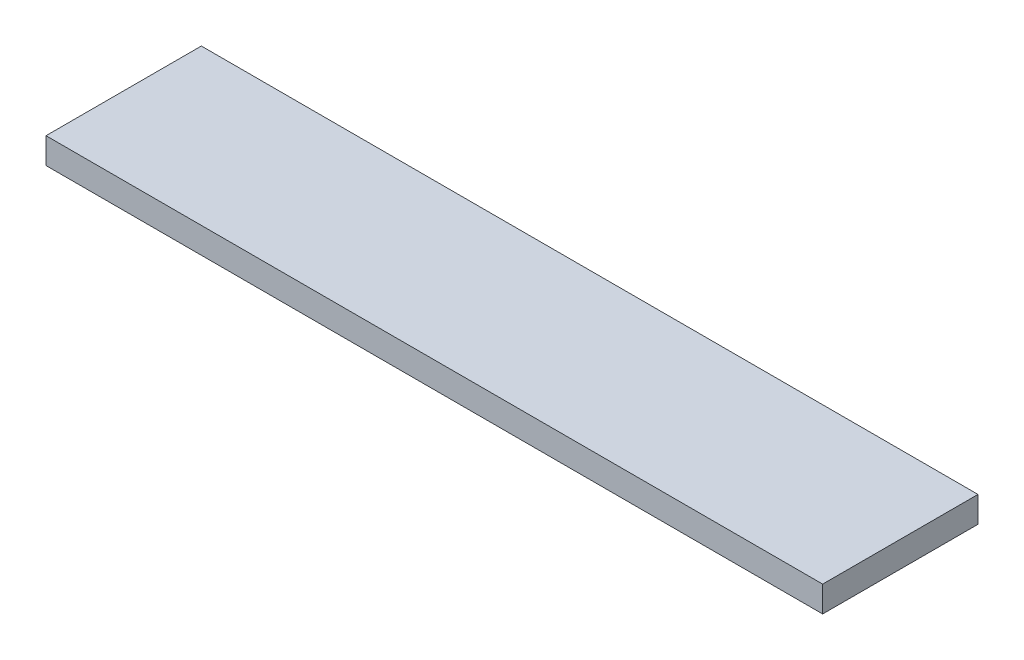
ISO-10303-21;
HEADER;
FILE_DESCRIPTION(('STEP AP214'),'2;1');
FILE_NAME('part.step','',(''),(''),'','','');
FILE_SCHEMA(('AUTOMOTIVE_DESIGN { 1 0 10303 214 1 1 1 1 }'));
ENDSEC;
DATA;
#1=APPLICATION_CONTEXT('core data for automotive mechanical design processes');
#2=APPLICATION_PROTOCOL_DEFINITION('international standard','automotive_design',2000,#1);
#3=PRODUCT_CONTEXT('',#1,'mechanical');
#4=PRODUCT('Part','Part','',(#3));
#5=PRODUCT_RELATED_PRODUCT_CATEGORY('part','',(#4));
#6=PRODUCT_DEFINITION_FORMATION('','',#4);
#7=PRODUCT_DEFINITION_CONTEXT('part definition',#1,'design');
#8=PRODUCT_DEFINITION('design','',#6,#7);
#9=PRODUCT_DEFINITION_SHAPE('','',#8);
#10=(LENGTH_UNIT() NAMED_UNIT(*) SI_UNIT(.MILLI.,.METRE.));
#11=(NAMED_UNIT(*) PLANE_ANGLE_UNIT() SI_UNIT($,.RADIAN.));
#12=(NAMED_UNIT(*) SI_UNIT($,.STERADIAN.) SOLID_ANGLE_UNIT());
#13=UNCERTAINTY_MEASURE_WITH_UNIT(LENGTH_MEASURE(1.E-05),#10,'distance_accuracy_value','');
#14=(GEOMETRIC_REPRESENTATION_CONTEXT(3) GLOBAL_UNCERTAINTY_ASSIGNED_CONTEXT((#13)) GLOBAL_UNIT_ASSIGNED_CONTEXT((#10,
#11,#12)) REPRESENTATION_CONTEXT('',''));
#15=CARTESIAN_POINT('',(0.,0.,0.));
#16=DIRECTION('',(0.,0.,1.));
#17=DIRECTION('',(1.,0.,0.));
#18=AXIS2_PLACEMENT_3D('',#15,#16,#17);
#19=CARTESIAN_POINT('',(95.25,6.35,-19.05));
#20=DIRECTION('',(-1.,0.,0.));
#21=DIRECTION('',(0.,0.,1.));
#22=AXIS2_PLACEMENT_3D('',#19,#20,#21);
#23=PLANE('',#22);
#24=DIRECTION('',(0.,0.,-1.));
#25=VECTOR('',#24,1.);
#26=CARTESIAN_POINT('',(95.25,0.,-19.05));
#27=LINE('',#26,#25);
#28=CARTESIAN_POINT('',(95.25,0.,19.05));
#29=VERTEX_POINT('',#28);
#30=CARTESIAN_POINT('',(95.25,0.,-19.05));
#31=VERTEX_POINT('',#30);
#32=EDGE_CURVE('E107',#29,#31,#27,.T.);
#33=ORIENTED_EDGE('',*,*,#32,.T.);
#34=DIRECTION('',(0.,-1.,0.));
#35=VECTOR('',#34,1.);
#36=CARTESIAN_POINT('',(95.25,6.35,-19.05));
#37=LINE('',#36,#35);
#38=CARTESIAN_POINT('',(95.25,6.35,-19.05));
#39=VERTEX_POINT('',#38);
#40=EDGE_CURVE('E11',#39,#31,#37,.T.);
#41=ORIENTED_EDGE('',*,*,#40,.F.);
#42=DIRECTION('',(0.,0.,-1.));
#43=VECTOR('',#42,1.);
#44=CARTESIAN_POINT('',(95.25,6.35,-19.05));
#45=LINE('',#44,#43);
#46=CARTESIAN_POINT('',(95.25,6.35,19.05));
#47=VERTEX_POINT('',#46);
#48=EDGE_CURVE('E91',#47,#39,#45,.T.);
#49=ORIENTED_EDGE('',*,*,#48,.F.);
#50=DIRECTION('',(0.,-1.,0.));
#51=VECTOR('',#50,1.);
#52=CARTESIAN_POINT('',(95.25,6.35,19.05));
#53=LINE('',#52,#51);
#54=EDGE_CURVE('E103',#47,#29,#53,.T.);
#55=ORIENTED_EDGE('',*,*,#54,.T.);
#56=EDGE_LOOP('',(#33,#41,#49,#55));
#57=FACE_BOUND('',#56,.T.);
#58=ADVANCED_FACE('F39',(#57),#23,.F.);
#59=CARTESIAN_POINT('',(-95.25,6.35,-19.05));
#60=DIRECTION('',(0.,0.,1.));
#61=DIRECTION('',(1.,0.,0.));
#62=AXIS2_PLACEMENT_3D('',#59,#60,#61);
#63=PLANE('',#62);
#64=DIRECTION('',(-1.,0.,0.));
#65=VECTOR('',#64,1.);
#66=CARTESIAN_POINT('',(-95.25,0.,-19.05));
#67=LINE('',#66,#65);
#68=CARTESIAN_POINT('',(-95.25,0.,-19.05));
#69=VERTEX_POINT('',#68);
#70=EDGE_CURVE('E96',#31,#69,#67,.T.);
#71=ORIENTED_EDGE('',*,*,#70,.T.);
#72=DIRECTION('',(0.,-1.,0.));
#73=VECTOR('',#72,1.);
#74=CARTESIAN_POINT('',(-95.25,6.35,-19.05));
#75=LINE('',#74,#73);
#76=CARTESIAN_POINT('',(-95.25,6.35,-19.05));
#77=VERTEX_POINT('',#76);
#78=EDGE_CURVE('E48',#77,#69,#75,.T.);
#79=ORIENTED_EDGE('',*,*,#78,.F.);
#80=DIRECTION('',(-1.,0.,0.));
#81=VECTOR('',#80,1.);
#82=CARTESIAN_POINT('',(-95.25,6.35,-19.05));
#83=LINE('',#82,#81);
#84=EDGE_CURVE('E86',#39,#77,#83,.T.);
#85=ORIENTED_EDGE('',*,*,#84,.F.);
#86=ORIENTED_EDGE('',*,*,#40,.T.);
#87=EDGE_LOOP('',(#71,#79,#85,#86));
#88=FACE_BOUND('',#87,.T.);
#89=ADVANCED_FACE('F95',(#88),#63,.F.);
#90=CARTESIAN_POINT('',(-95.25,6.35,-19.05));
#91=DIRECTION('',(1.,0.,0.));
#92=DIRECTION('',(0.,0.,-1.));
#93=AXIS2_PLACEMENT_3D('',#90,#91,#92);
#94=PLANE('',#93);
#95=DIRECTION('',(0.,0.,1.));
#96=VECTOR('',#95,1.);
#97=CARTESIAN_POINT('',(-95.25,0.,-19.05));
#98=LINE('',#97,#96);
#99=CARTESIAN_POINT('',(-95.25,0.,19.05));
#100=VERTEX_POINT('',#99);
#101=EDGE_CURVE('E73',#69,#100,#98,.T.);
#102=ORIENTED_EDGE('',*,*,#101,.T.);
#103=DIRECTION('',(0.,-1.,0.));
#104=VECTOR('',#103,1.);
#105=CARTESIAN_POINT('',(-95.25,6.35,19.05));
#106=LINE('',#105,#104);
#107=CARTESIAN_POINT('',(-95.25,6.35,19.05));
#108=VERTEX_POINT('',#107);
#109=EDGE_CURVE('E98',#108,#100,#106,.T.);
#110=ORIENTED_EDGE('',*,*,#109,.F.);
#111=DIRECTION('',(0.,0.,1.));
#112=VECTOR('',#111,1.);
#113=CARTESIAN_POINT('',(-95.25,6.35,-19.05));
#114=LINE('',#113,#112);
#115=EDGE_CURVE('E89',#77,#108,#114,.T.);
#116=ORIENTED_EDGE('',*,*,#115,.F.);
#117=ORIENTED_EDGE('',*,*,#78,.T.);
#118=EDGE_LOOP('',(#102,#110,#116,#117));
#119=FACE_BOUND('',#118,.T.);
#120=ADVANCED_FACE('F99',(#119),#94,.F.);
#121=CARTESIAN_POINT('',(-95.25,6.35,19.05));
#122=DIRECTION('',(0.,0.,-1.));
#123=DIRECTION('',(-1.,0.,0.));
#124=AXIS2_PLACEMENT_3D('',#121,#122,#123);
#125=PLANE('',#124);
#126=DIRECTION('',(1.,0.,0.));
#127=VECTOR('',#126,1.);
#128=CARTESIAN_POINT('',(-95.25,0.,19.05));
#129=LINE('',#128,#127);
#130=EDGE_CURVE('E79',#100,#29,#129,.T.);
#131=ORIENTED_EDGE('',*,*,#130,.T.);
#132=ORIENTED_EDGE('',*,*,#54,.F.);
#133=DIRECTION('',(1.,0.,0.));
#134=VECTOR('',#133,1.);
#135=CARTESIAN_POINT('',(-95.25,6.35,19.05));
#136=LINE('',#135,#134);
#137=EDGE_CURVE('E56',#108,#47,#136,.T.);
#138=ORIENTED_EDGE('',*,*,#137,.F.);
#139=ORIENTED_EDGE('',*,*,#109,.T.);
#140=EDGE_LOOP('',(#131,#132,#138,#139));
#141=FACE_BOUND('',#140,.T.);
#142=ADVANCED_FACE('F120',(#141),#125,.F.);
#143=CARTESIAN_POINT('',(0.,6.35,0.));
#144=DIRECTION('',(0.,1.,0.));
#145=DIRECTION('',(0.,0.,1.));
#146=AXIS2_PLACEMENT_3D('',#143,#144,#145);
#147=PLANE('',#146);
#148=ORIENTED_EDGE('',*,*,#48,.T.);
#149=ORIENTED_EDGE('',*,*,#84,.T.);
#150=ORIENTED_EDGE('',*,*,#115,.T.);
#151=ORIENTED_EDGE('',*,*,#137,.T.);
#152=EDGE_LOOP('',(#148,#149,#150,#151));
#153=FACE_BOUND('',#152,.T.);
#154=ADVANCED_FACE('F87',(#153),#147,.T.);
#155=CARTESIAN_POINT('',(0.,0.,0.));
#156=DIRECTION('',(0.,1.,0.));
#157=DIRECTION('',(0.,0.,1.));
#158=AXIS2_PLACEMENT_3D('',#155,#156,#157);
#159=PLANE('',#158);
#160=ORIENTED_EDGE('',*,*,#32,.F.);
#161=ORIENTED_EDGE('',*,*,#130,.F.);
#162=ORIENTED_EDGE('',*,*,#101,.F.);
#163=ORIENTED_EDGE('',*,*,#70,.F.);
#164=EDGE_LOOP('',(#160,#161,#162,#163));
#165=FACE_BOUND('',#164,.T.);
#166=ADVANCED_FACE('F123',(#165),#159,.F.);
#167=CLOSED_SHELL('',(#58,#89,#120,#142,#154,#166));
#168=MANIFOLD_SOLID_BREP('B2',#167);
#169=ADVANCED_BREP_SHAPE_REPRESENTATION('',(#18,#168),#14);
#170=SHAPE_DEFINITION_REPRESENTATION(#9,#169);
ENDSEC;
END-ISO-10303-21;
